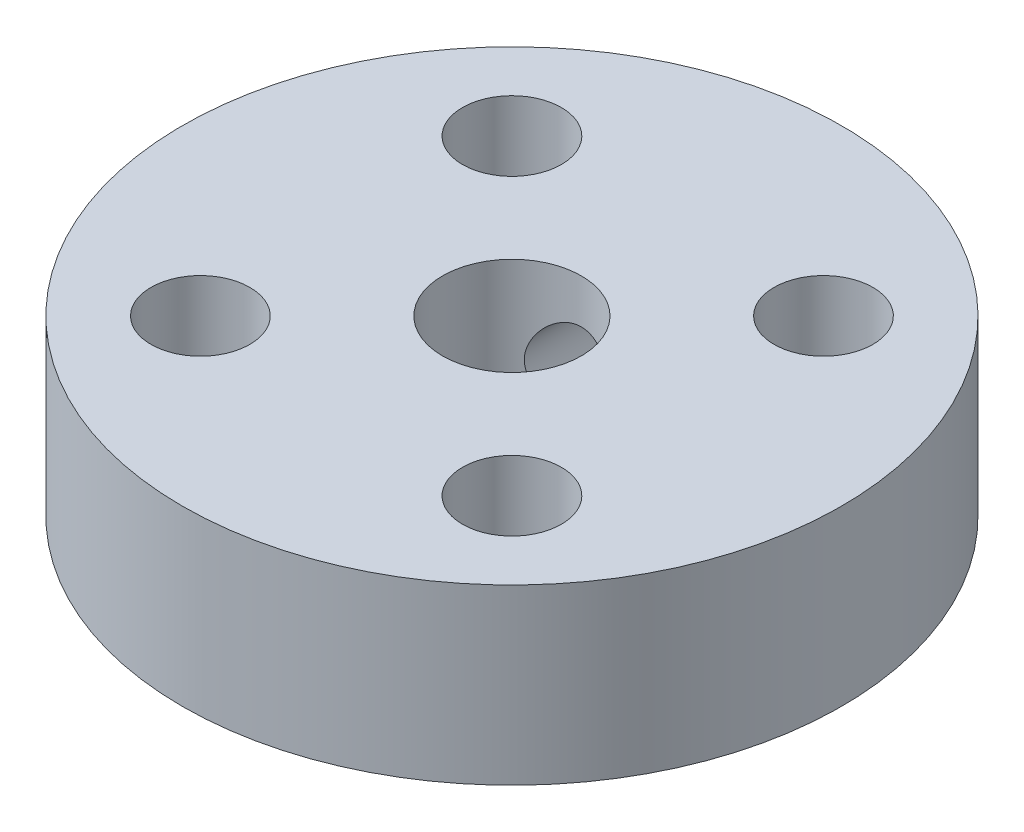
ISO-10303-21;
HEADER;
FILE_DESCRIPTION(('STEP AP214'),'2;1');
FILE_NAME('part.step','',(''),(''),'','','');
FILE_SCHEMA(('AUTOMOTIVE_DESIGN { 1 0 10303 214 1 1 1 1 }'));
ENDSEC;
DATA;
#1=APPLICATION_CONTEXT('core data for automotive mechanical design processes');
#2=APPLICATION_PROTOCOL_DEFINITION('international standard','automotive_design',2000,#1);
#3=PRODUCT_CONTEXT('',#1,'mechanical');
#4=PRODUCT('Part','Part','',(#3));
#5=PRODUCT_RELATED_PRODUCT_CATEGORY('part','',(#4));
#6=PRODUCT_DEFINITION_FORMATION('','',#4);
#7=PRODUCT_DEFINITION_CONTEXT('part definition',#1,'design');
#8=PRODUCT_DEFINITION('design','',#6,#7);
#9=PRODUCT_DEFINITION_SHAPE('','',#8);
#10=(LENGTH_UNIT() NAMED_UNIT(*) SI_UNIT(.MILLI.,.METRE.));
#11=(NAMED_UNIT(*) PLANE_ANGLE_UNIT() SI_UNIT($,.RADIAN.));
#12=(NAMED_UNIT(*) SI_UNIT($,.STERADIAN.) SOLID_ANGLE_UNIT());
#13=UNCERTAINTY_MEASURE_WITH_UNIT(LENGTH_MEASURE(1.E-05),#10,'distance_accuracy_value','');
#14=(GEOMETRIC_REPRESENTATION_CONTEXT(3) GLOBAL_UNCERTAINTY_ASSIGNED_CONTEXT((#13)) GLOBAL_UNIT_ASSIGNED_CONTEXT((#10,
#11,#12)) REPRESENTATION_CONTEXT('',''));
#15=CARTESIAN_POINT('',(0.,0.,0.));
#16=DIRECTION('',(0.,0.,1.));
#17=DIRECTION('',(1.,0.,0.));
#18=AXIS2_PLACEMENT_3D('',#15,#16,#17);
#19=CARTESIAN_POINT('',(0.,5.,0.));
#20=DIRECTION('',(0.,1.,0.));
#21=DIRECTION('',(0.,0.,1.));
#22=AXIS2_PLACEMENT_3D('',#19,#20,#21);
#23=PLANE('',#22);
#24=CARTESIAN_POINT('',(4.4901280605346,5.,4.49012806053455));
#25=DIRECTION('',(0.,1.,0.));
#26=DIRECTION('',(0.,0.,1.));
#27=AXIS2_PLACEMENT_3D('',#24,#25,#26);
#28=CIRCLE('',#27,1.425);
#29=CARTESIAN_POINT('',(4.4901280605346,5.,5.91512806053455));
#30=VERTEX_POINT('',#29);
#31=EDGE_CURVE('E58',#30,#30,#28,.T.);
#32=ORIENTED_EDGE('',*,*,#31,.F.);
#33=EDGE_LOOP('',(#32));
#34=FACE_BOUND('',#33,.T.);
#35=CARTESIAN_POINT('',(-4.4901280605346,5.,-4.49012806053455));
#36=DIRECTION('',(0.,1.,0.));
#37=DIRECTION('',(0.,0.,1.));
#38=AXIS2_PLACEMENT_3D('',#35,#36,#37);
#39=CIRCLE('',#38,1.425);
#40=CARTESIAN_POINT('',(-4.4901280605346,5.,-3.06512806053455));
#41=VERTEX_POINT('',#40);
#42=EDGE_CURVE('E46',#41,#41,#39,.T.);
#43=ORIENTED_EDGE('',*,*,#42,.F.);
#44=EDGE_LOOP('',(#43));
#45=FACE_BOUND('',#44,.T.);
#46=CARTESIAN_POINT('',(0.,5.,0.));
#47=DIRECTION('',(0.,1.,0.));
#48=DIRECTION('',(0.,0.,1.));
#49=AXIS2_PLACEMENT_3D('',#46,#47,#48);
#50=CIRCLE('',#49,9.5);
#51=CARTESIAN_POINT('',(0.,5.,9.5));
#52=VERTEX_POINT('',#51);
#53=EDGE_CURVE('E10',#52,#52,#50,.T.);
#54=ORIENTED_EDGE('',*,*,#53,.T.);
#55=EDGE_LOOP('',(#54));
#56=FACE_BOUND('',#55,.T.);
#57=CARTESIAN_POINT('',(0.,5.,0.));
#58=DIRECTION('',(0.,1.,0.));
#59=DIRECTION('',(0.,0.,1.));
#60=AXIS2_PLACEMENT_3D('',#57,#58,#59);
#61=CIRCLE('',#60,2.);
#62=CARTESIAN_POINT('',(0.,5.,2.));
#63=VERTEX_POINT('',#62);
#64=EDGE_CURVE('E41',#63,#63,#61,.T.);
#65=ORIENTED_EDGE('',*,*,#64,.F.);
#66=EDGE_LOOP('',(#65));
#67=FACE_BOUND('',#66,.T.);
#68=CARTESIAN_POINT('',(4.4901280605346,5.,-4.49012806053455));
#69=DIRECTION('',(0.,1.,0.));
#70=DIRECTION('',(0.,0.,-1.));
#71=AXIS2_PLACEMENT_3D('',#68,#69,#70);
#72=CIRCLE('',#71,1.425);
#73=CARTESIAN_POINT('',(4.4901280605346,5.,-5.91512806053455));
#74=VERTEX_POINT('',#73);
#75=EDGE_CURVE('E52',#74,#74,#72,.T.);
#76=ORIENTED_EDGE('',*,*,#75,.F.);
#77=EDGE_LOOP('',(#76));
#78=FACE_BOUND('',#77,.T.);
#79=CARTESIAN_POINT('',(-4.4901280605346,5.,4.49012806053455));
#80=DIRECTION('',(0.,1.,0.));
#81=DIRECTION('',(0.,0.,-1.));
#82=AXIS2_PLACEMENT_3D('',#79,#80,#81);
#83=CIRCLE('',#82,1.425);
#84=CARTESIAN_POINT('',(-4.4901280605346,5.,3.06512806053455));
#85=VERTEX_POINT('',#84);
#86=EDGE_CURVE('E64',#85,#85,#83,.T.);
#87=ORIENTED_EDGE('',*,*,#86,.F.);
#88=EDGE_LOOP('',(#87));
#89=FACE_BOUND('',#88,.T.);
#90=ADVANCED_FACE('F30',(#34,#45,#56,#67,#78,#89),#23,.T.);
#91=CARTESIAN_POINT('',(0.,0.,0.));
#92=DIRECTION('',(0.,1.,0.));
#93=DIRECTION('',(0.,0.,1.));
#94=AXIS2_PLACEMENT_3D('',#91,#92,#93);
#95=PLANE('',#94);
#96=CARTESIAN_POINT('',(0.,0.,0.));
#97=DIRECTION('',(0.,1.,0.));
#98=DIRECTION('',(0.,0.,1.));
#99=AXIS2_PLACEMENT_3D('',#96,#97,#98);
#100=CIRCLE('',#99,9.5);
#101=CARTESIAN_POINT('',(0.,0.,9.5));
#102=VERTEX_POINT('',#101);
#103=EDGE_CURVE('E34',#102,#102,#100,.T.);
#104=ORIENTED_EDGE('',*,*,#103,.F.);
#105=EDGE_LOOP('',(#104));
#106=FACE_BOUND('',#105,.T.);
#107=CARTESIAN_POINT('',(0.,0.,0.));
#108=DIRECTION('',(0.,1.,0.));
#109=DIRECTION('',(0.,0.,1.));
#110=AXIS2_PLACEMENT_3D('',#107,#108,#109);
#111=CIRCLE('',#110,2.);
#112=CARTESIAN_POINT('',(0.,0.,2.));
#113=VERTEX_POINT('',#112);
#114=EDGE_CURVE('E43',#113,#113,#111,.T.);
#115=ORIENTED_EDGE('',*,*,#114,.T.);
#116=EDGE_LOOP('',(#115));
#117=FACE_BOUND('',#116,.T.);
#118=CARTESIAN_POINT('',(-4.4901280605346,0.,-4.49012806053455));
#119=DIRECTION('',(0.,1.,0.));
#120=DIRECTION('',(0.,0.,1.));
#121=AXIS2_PLACEMENT_3D('',#118,#119,#120);
#122=CIRCLE('',#121,1.425);
#123=CARTESIAN_POINT('',(-4.4901280605346,0.,-3.06512806053455));
#124=VERTEX_POINT('',#123);
#125=EDGE_CURVE('E49',#124,#124,#122,.T.);
#126=ORIENTED_EDGE('',*,*,#125,.T.);
#127=EDGE_LOOP('',(#126));
#128=FACE_BOUND('',#127,.T.);
#129=CARTESIAN_POINT('',(4.4901280605346,0.,-4.49012806053455));
#130=DIRECTION('',(0.,1.,0.));
#131=DIRECTION('',(0.,0.,-1.));
#132=AXIS2_PLACEMENT_3D('',#129,#130,#131);
#133=CIRCLE('',#132,1.425);
#134=CARTESIAN_POINT('',(4.4901280605346,0.,-5.91512806053455));
#135=VERTEX_POINT('',#134);
#136=EDGE_CURVE('E55',#135,#135,#133,.T.);
#137=ORIENTED_EDGE('',*,*,#136,.T.);
#138=EDGE_LOOP('',(#137));
#139=FACE_BOUND('',#138,.T.);
#140=CARTESIAN_POINT('',(4.4901280605346,0.,4.49012806053455));
#141=DIRECTION('',(0.,1.,0.));
#142=DIRECTION('',(0.,0.,1.));
#143=AXIS2_PLACEMENT_3D('',#140,#141,#142);
#144=CIRCLE('',#143,1.425);
#145=CARTESIAN_POINT('',(4.4901280605346,0.,5.91512806053455));
#146=VERTEX_POINT('',#145);
#147=EDGE_CURVE('E61',#146,#146,#144,.T.);
#148=ORIENTED_EDGE('',*,*,#147,.T.);
#149=EDGE_LOOP('',(#148));
#150=FACE_BOUND('',#149,.T.);
#151=CARTESIAN_POINT('',(-4.4901280605346,0.,4.49012806053455));
#152=DIRECTION('',(0.,1.,0.));
#153=DIRECTION('',(0.,0.,-1.));
#154=AXIS2_PLACEMENT_3D('',#151,#152,#153);
#155=CIRCLE('',#154,1.425);
#156=CARTESIAN_POINT('',(-4.4901280605346,0.,3.06512806053455));
#157=VERTEX_POINT('',#156);
#158=EDGE_CURVE('E67',#157,#157,#155,.T.);
#159=ORIENTED_EDGE('',*,*,#158,.T.);
#160=EDGE_LOOP('',(#159));
#161=FACE_BOUND('',#160,.T.);
#162=ADVANCED_FACE('F112',(#106,#117,#128,#139,#150,#161),#95,.F.);
#163=CARTESIAN_POINT('',(0.,5.,0.));
#164=DIRECTION('',(0.,-1.,0.));
#165=DIRECTION('',(0.,0.,-1.));
#166=AXIS2_PLACEMENT_3D('',#163,#164,#165);
#167=CYLINDRICAL_SURFACE('',#166,9.5);
#168=CARTESIAN_POINT('',(-1.225,2.5,-9.42068866909421));
#169=CARTESIAN_POINT('',(-1.22499709865934,2.56850119476712,-9.42068968008304));
#170=CARTESIAN_POINT('',(-1.21923479283014,2.6370447592432,-9.42144388417472));
#171=CARTESIAN_POINT('',(-1.19633965153308,2.77222302420468,-9.42437793764247));
#172=CARTESIAN_POINT('',(-1.1791950498231,2.83885567488312,-9.42655926224454));
#173=CARTESIAN_POINT('',(-1.13405027100076,2.96823545388233,-9.43209647166226));
#174=CARTESIAN_POINT('',(-1.10605760197875,3.03098523483047,-9.43545154395581));
#175=CARTESIAN_POINT('',(-1.04002762035908,3.15088540878797,-9.44295724017658));
#176=CARTESIAN_POINT('',(-1.0019919758161,3.20803672949583,-9.44710773195988));
#177=CARTESIAN_POINT('',(-0.91671354986486,3.31546884468767,-9.45576424826968));
#178=CARTESIAN_POINT('',(-0.869422924253469,3.36571152249943,-9.4602720445942));
#179=CARTESIAN_POINT('',(-0.767079996828368,3.45757073467239,-9.46911934002949));
#180=CARTESIAN_POINT('',(-0.712027303364591,3.49918683350105,-9.47345883063398));
#181=CARTESIAN_POINT('',(-0.595482661690747,3.57274891533215,-9.48149877143937));
#182=CARTESIAN_POINT('',(-0.533968705418879,3.60466030435623,-9.48519691579327));
#183=CARTESIAN_POINT('',(-0.406399064978234,3.65768548186576,-9.49151798583682));
#184=CARTESIAN_POINT('',(-0.340343559854838,3.67879969574093,-9.49414095388573));
#185=CARTESIAN_POINT('',(-0.205956211650491,3.70951701440922,-9.4980036518478));
#186=CARTESIAN_POINT('',(-0.13763909495843,3.71918357285662,-9.49925100404057));
#187=CARTESIAN_POINT('',(-0.000341748230942986,3.72692788963726,-9.50024797059137));
#188=CARTESIAN_POINT('',(0.068638454020692,3.72500613143482,-9.4999976474324));
#189=CARTESIAN_POINT('',(0.204871983670085,3.70967910541163,-9.49803362376351));
#190=CARTESIAN_POINT('',(0.272133132166906,3.69634208362378,-9.4963286202373));
#191=CARTESIAN_POINT('',(0.403454548429558,3.65866986663005,-9.49165656214839));
#192=CARTESIAN_POINT('',(0.467514752040359,3.63433445108667,-9.48868948230183));
#193=CARTESIAN_POINT('',(0.590826431677813,3.57528406300864,-9.48181167065156));
#194=CARTESIAN_POINT('',(0.650063666318719,3.54053967437055,-9.47789827064131));
#195=CARTESIAN_POINT('',(0.761892536540219,3.46167901529738,-9.46956540351521));
#196=CARTESIAN_POINT('',(0.814483847675381,3.41756228759844,-9.46514591171268));
#197=CARTESIAN_POINT('',(0.911929141022382,3.32082732235275,-9.45625727078792));
#198=CARTESIAN_POINT('',(0.956724072172464,3.26814959104126,-9.45178799427617));
#199=CARTESIAN_POINT('',(1.03684578034223,3.15599199010327,-9.44333516613547));
#200=CARTESIAN_POINT('',(1.07217252414367,3.09651209661306,-9.43935161621067));
#201=CARTESIAN_POINT('',(1.13235910536284,2.97238466886437,-9.43232134352188));
#202=CARTESIAN_POINT('',(1.15721401733789,2.90773471983353,-9.42927506178475));
#203=CARTESIAN_POINT('',(1.19569800568057,2.77513057580906,-9.42447270941835));
#204=CARTESIAN_POINT('',(1.20932765905175,2.70717655084254,-9.42271657247324));
#205=CARTESIAN_POINT('',(1.22489562531942,2.57041531713493,-9.42070554215065));
#206=CARTESIAN_POINT('',(1.22691712952424,2.50161772951241,-9.42043996678131));
#207=CARTESIAN_POINT('',(1.21943109855477,2.36466485582994,-9.42141186251064));
#208=CARTESIAN_POINT('',(1.20992382530383,2.29650955521326,-9.42264929946224));
#209=CARTESIAN_POINT('',(1.17972023734672,2.16302646631099,-9.42647803518881));
#210=CARTESIAN_POINT('',(1.15906437506381,2.09768937217438,-9.42906443813355));
#211=CARTESIAN_POINT('',(1.10719165791381,1.97140591034599,-9.43529570470319));
#212=CARTESIAN_POINT('',(1.07597440955179,1.91045970635213,-9.43894060776486));
#213=CARTESIAN_POINT('',(1.00366120554461,1.79431218431,-9.44690371262752));
#214=CARTESIAN_POINT('',(0.962510797466786,1.73914502353837,-9.45122557794094));
#215=CARTESIAN_POINT('',(0.871576170013216,1.63647047895179,-9.46004421015653));
#216=CARTESIAN_POINT('',(0.821791592798144,1.5889634127636,-9.46454098430172));
#217=CARTESIAN_POINT('',(0.714637979391556,1.5026644172879,-9.47323565943418));
#218=CARTESIAN_POINT('',(0.657224677630269,1.46392722209951,-9.4774315774273));
#219=CARTESIAN_POINT('',(0.536658052416349,1.39664668034297,-9.48502195656067));
#220=CARTESIAN_POINT('',(0.473504850999519,1.36810311711194,-9.48841643473478));
#221=CARTESIAN_POINT('',(0.343431378376751,1.32211004489426,-9.4940126841113));
#222=CARTESIAN_POINT('',(0.276522354598678,1.30462915415568,-9.49621782647846));
#223=CARTESIAN_POINT('',(0.140688479557643,1.28115562761889,-9.49920096649316));
#224=CARTESIAN_POINT('',(0.071763725489932,1.2751624388265,-9.49997903283711));
#225=CARTESIAN_POINT('',(-0.0656111858377317,1.2748452363498,-9.50001997731717));
#226=CARTESIAN_POINT('',(-0.134061160436176,1.28043692223984,-9.49929380147855));
#227=CARTESIAN_POINT('',(-0.269039738514282,1.30295188328429,-9.49642965580152));
#228=CARTESIAN_POINT('',(-0.33556834394316,1.31987514694247,-9.49429168739544));
#229=CARTESIAN_POINT('',(-0.46480284180257,1.36454588323132,-9.48884308963059));
#230=CARTESIAN_POINT('',(-0.527510243432013,1.39228905004048,-9.4855329267992));
#231=CARTESIAN_POINT('',(-0.647392805316869,1.457803317978,-9.47810603907808));
#232=CARTESIAN_POINT('',(-0.704567882761629,1.49557456918017,-9.47398930211794));
#233=CARTESIAN_POINT('',(-0.812193090166347,1.58038375295096,-9.46537278747054));
#234=CARTESIAN_POINT('',(-0.862593639257869,1.62748435840921,-9.46087054299941));
#235=CARTESIAN_POINT('',(-0.954808074519508,1.72948459783111,-9.45201001533674));
#236=CARTESIAN_POINT('',(-0.996619927570788,1.78438607322779,-9.44765176643629));
#237=CARTESIAN_POINT('',(-1.07061830989047,1.90068953273254,-9.43955358876871));
#238=CARTESIAN_POINT('',(-1.10276459219988,1.9621172947508,-9.43581627364353));
#239=CARTESIAN_POINT('',(-1.156238941261,2.08951407845013,-9.42941372919864));
#240=CARTESIAN_POINT('',(-1.17757869584358,2.15547810580789,-9.42674734226222));
#241=CARTESIAN_POINT('',(-1.20376377300374,2.26814775002131,-9.42343143541802));
#242=CARTESIAN_POINT('',(-1.21171580127918,2.31414465794692,-9.42240806793997));
#243=CARTESIAN_POINT('',(-1.222334880445,2.40675450221404,-9.42103634345504));
#244=CARTESIAN_POINT('',(-1.22500197510368,2.45336743345059,-9.42068798085798));
#245=CARTESIAN_POINT('',(-1.225,2.5,-9.42068866909421));
#246=B_SPLINE_CURVE_WITH_KNOTS('',3,(#168,#169,#170,#171,#172,#173,#174,#175,#176,#177,#178,
#179,#180,#181,#182,#183,#184,#185,#186,#187,#188,#189,#190,#191,#192,#193,#194,#195,#196,#197,
#198,#199,#200,#201,#202,#203,#204,#205,#206,#207,#208,#209,#210,#211,#212,#213,#214,#215,#216,
#217,#218,#219,#220,#221,#222,#223,#224,#225,#226,#227,#228,#229,#230,#231,#232,#233,#234,#235,
#236,#237,#238,#239,#240,#241,#242,#243,#244,#245),.UNSPECIFIED.,.T.,.F.,(4,2,2,2,2,2,2,2,2,2,2,
2,2,2,2,2,2,2,2,2,2,2,2,2,2,2,2,2,2,2,2,2,2,2,2,2,2,2,4),(0.,0.205333215114874,
0.410879020910187,0.616282819086175,0.821652522836657,1.0281133640807,1.23458462643422,
1.44178348683321,1.64897418333223,1.85501097753251,2.06103917594161,2.26584417243452,
2.4706532720923,2.67604671827297,2.88145018762689,3.08834744940733,3.29524543705798,
3.50224063115709,3.70922518457355,3.91472448691588,4.12021912058811,4.32497308534553,
4.52973467964317,4.7356453165044,4.94156448928137,5.14873542685684,5.35590196080826,
5.56247815461618,5.76904440402421,5.97411279980967,6.17918098754738,6.38416765075679,
6.58915738183673,6.79557399358082,7.00203941216271,7.20935300158032,7.41644188893379,
7.5562247664638,7.6960064863477),.UNSPECIFIED.);
#247=CARTESIAN_POINT('',(-1.225,2.5,-9.42068866909421));
#248=VERTEX_POINT('',#247);
#249=EDGE_CURVE('E79',#248,#248,#246,.T.);
#250=ORIENTED_EDGE('',*,*,#249,.F.);
#251=EDGE_LOOP('',(#250));
#252=FACE_BOUND('',#251,.T.);
#253=ORIENTED_EDGE('',*,*,#53,.F.);
#254=EDGE_LOOP('',(#253));
#255=FACE_BOUND('',#254,.T.);
#256=ORIENTED_EDGE('',*,*,#103,.T.);
#257=EDGE_LOOP('',(#256));
#258=FACE_BOUND('',#257,.T.);
#259=ADVANCED_FACE('F32',(#252,#255,#258),#167,.T.);
#260=CARTESIAN_POINT('',(0.,5.,0.));
#261=DIRECTION('',(0.,-1.,0.));
#262=DIRECTION('',(0.,0.,-1.));
#263=AXIS2_PLACEMENT_3D('',#260,#261,#262);
#264=CYLINDRICAL_SURFACE('',#263,2.);
#265=CARTESIAN_POINT('',(-1.225,2.5,-1.58094117537624));
#266=CARTESIAN_POINT('',(-1.22499122147415,2.56120620332825,-1.5809539788787));
#267=CARTESIAN_POINT('',(-1.2203723876472,2.62249395363184,-1.5845609560338));
#268=CARTESIAN_POINT('',(-1.20220361919125,2.74305443233471,-1.59838193059175));
#269=CARTESIAN_POINT('',(-1.1886273103594,2.80232066500172,-1.60861543735262));
#270=CARTESIAN_POINT('',(-1.15348662694621,2.91670820721222,-1.63399191134482));
#271=CARTESIAN_POINT('',(-1.13198912026802,2.97185969488396,-1.64909365283668));
#272=CARTESIAN_POINT('',(-1.08181120544,3.07770598551229,-1.68243574341253));
#273=CARTESIAN_POINT('',(-1.05313114331982,3.12840100300664,-1.70067594128375));
#274=CARTESIAN_POINT('',(-0.98511491413823,3.23105034980388,-1.741064189181));
#275=CARTESIAN_POINT('',(-0.944883972757908,3.28233284791586,-1.76341343791531));
#276=CARTESIAN_POINT('',(-0.856736512751712,3.37798749191381,-1.80788375439534));
#277=CARTESIAN_POINT('',(-0.808813529713482,3.422353763014,-1.83000461341121));
#278=CARTESIAN_POINT('',(-0.700014852753092,3.50792907961455,-1.87451642871692));
#279=CARTESIAN_POINT('',(-0.638285036903312,3.54819951239879,-1.89664993622898));
#280=CARTESIAN_POINT('',(-0.507312576535772,3.61746577489249,-1.93579134016997));
#281=CARTESIAN_POINT('',(-0.43807720031144,3.64647238976909,-1.95280413617964));
#282=CARTESIAN_POINT('',(-0.30126228630364,3.68932135994803,-1.97828081943678));
#283=CARTESIAN_POINT('',(-0.234191994672972,3.70437644408653,-1.98742197507357));
#284=CARTESIAN_POINT('',(-0.0979215837997548,3.72300910326114,-1.99876675643667));
#285=CARTESIAN_POINT('',(-0.0287236524841506,3.72659809538545,-2.00097728313089));
#286=CARTESIAN_POINT('',(0.100194961644733,3.72237483164824,-1.99839356162764));
#287=CARTESIAN_POINT('',(0.159986220722439,3.71597419490876,-1.99446650184842));
#288=CARTESIAN_POINT('',(0.277455220580947,3.69465746203092,-1.98154217338069));
#289=CARTESIAN_POINT('',(0.335132801363347,3.67974072266307,-1.97254452170611));
#290=CARTESIAN_POINT('',(0.447195549813713,3.64199622308899,-1.95020482645198));
#291=CARTESIAN_POINT('',(0.501565681914992,3.61913510840009,-1.93684448058774));
#292=CARTESIAN_POINT('',(0.605753034571028,3.56635002352211,-1.90683152844591));
#293=CARTESIAN_POINT('',(0.655569142925062,3.53642433435497,-1.89017812104894));
#294=CARTESIAN_POINT('',(0.755753589264726,3.46625334650885,-1.85257563753712));
#295=CARTESIAN_POINT('',(0.805447607065019,3.42519440982087,-1.83135035457286));
#296=CARTESIAN_POINT('',(0.897671002895369,3.33602307160525,-1.78795717916508));
#297=CARTESIAN_POINT('',(0.940190116448492,3.28790074598303,-1.7657879921639));
#298=CARTESIAN_POINT('',(1.02216647440352,3.17897343231021,-1.71978015012407));
#299=CARTESIAN_POINT('',(1.06060111057787,3.1173363511981,-1.69607231164618));
#300=CARTESIAN_POINT('',(1.12638646804965,2.987012058473,-1.65311942761175));
#301=CARTESIAN_POINT('',(1.15375769840297,2.91833819060353,-1.63386615290721));
#302=CARTESIAN_POINT('',(1.19053390778286,2.79381201306798,-1.60717373797391));
#303=CARTESIAN_POINT('',(1.20274243278461,2.73916667198975,-1.5979729601045));
#304=CARTESIAN_POINT('',(1.21957315180789,2.62810329693352,-1.58516812947171));
#305=CARTESIAN_POINT('',(1.22420491990948,2.57168759207479,-1.58155701385547));
#306=CARTESIAN_POINT('',(1.22560791264349,2.45859601983087,-1.58047035593654));
#307=CARTESIAN_POINT('',(1.22236489925028,2.40191986640861,-1.58300592715822));
#308=CARTESIAN_POINT('',(1.2081988053153,2.29008648754689,-1.59384157802492));
#309=CARTESIAN_POINT('',(1.19726948777725,2.23493053345897,-1.6021463389706));
#310=CARTESIAN_POINT('',(1.1684393803391,2.12794961656836,-1.62328722211386));
#311=CARTESIAN_POINT('',(1.1505984988789,2.07610037176594,-1.63608431828205));
#312=CARTESIAN_POINT('',(1.10859533903588,1.97598443919135,-1.66483119213558));
#313=CARTESIAN_POINT('',(1.08443075420732,1.92771906682826,-1.68078211959852));
#314=CARTESIAN_POINT('',(1.02530036073911,1.82663503593026,-1.71760994257343));
#315=CARTESIAN_POINT('',(0.989162164500907,1.77463453463172,-1.7388515832906));
#316=CARTESIAN_POINT('',(0.909439015008524,1.67687795496683,-1.78184629839693));
#317=CARTESIAN_POINT('',(0.865846598978016,1.63112821792858,-1.80359986629392));
#318=CARTESIAN_POINT('',(0.764950400226492,1.54046154679785,-1.84887267283765));
#319=CARTESIAN_POINT('',(0.706575309313424,1.4966232288238,-1.87219186233137));
#320=CARTESIAN_POINT('',(0.581832515257148,1.41950890359171,-1.91462808186235));
#321=CARTESIAN_POINT('',(0.515469451634931,1.38622680558694,-1.93374753310689));
#322=CARTESIAN_POINT('',(0.381085180966447,1.33370407194699,-1.96448449214685));
#323=CARTESIAN_POINT('',(0.313471995061788,1.31367295087942,-1.97651834447809));
#324=CARTESIAN_POINT('',(0.17497973581579,1.28551157388461,-1.99354651128063));
#325=CARTESIAN_POINT('',(0.104104873389868,1.27736639414246,-1.99854965311692));
#326=CARTESIAN_POINT('',(-0.0280642880117464,1.27379412073637,-2.00073945831122));
#327=CARTESIAN_POINT('',(-0.089304860170021,1.27674020931281,-1.99892601283891));
#328=CARTESIAN_POINT('',(-0.210257875910212,1.29164259892076,-1.98984098555084));
#329=CARTESIAN_POINT('',(-0.269970340979631,1.30359877318475,-1.98256948052733));
#330=CARTESIAN_POINT('',(-0.384771442844798,1.3355083394685,-1.96348108234412));
#331=CARTESIAN_POINT('',(-0.439938297166457,1.3552546317581,-1.95178219533932));
#332=CARTESIAN_POINT('',(-0.546157075968082,1.40195337693111,-1.92476471093372));
#333=CARTESIAN_POINT('',(-0.597208211118611,1.42890720784708,-1.90944542140163));
#334=CARTESIAN_POINT('',(-0.699630357754697,1.49245207814085,-1.87449956080282));
#335=CARTESIAN_POINT('',(-0.750455353872598,1.52976414935293,-1.85458791602334));
#336=CARTESIAN_POINT('',(-0.845507756854067,1.61136475197523,-1.81323183989662));
#337=CARTESIAN_POINT('',(-0.889727427740392,1.65566134062885,-1.79178565412615));
#338=CARTESIAN_POINT('',(-0.976511453519425,1.75697438542684,-1.74617849039532));
#339=CARTESIAN_POINT('',(-1.0180334653938,1.81490140101793,-1.72204481735953));
#340=CARTESIAN_POINT('',(-1.09081914521455,1.9380057057893,-1.67688746505844));
#341=CARTESIAN_POINT('',(-1.12209009927782,2.00317780109014,-1.65586158273938));
#342=CARTESIAN_POINT('',(-1.167354027814,2.12435054220383,-1.62415246344603));
#343=CARTESIAN_POINT('',(-1.183643761339,2.17916235887018,-1.61220874933955));
#344=CARTESIAN_POINT('',(-1.20844465733026,2.29129714241417,-1.59370967295701));
#345=CARTESIAN_POINT('',(-1.21698134319469,2.34861121379395,-1.5871366373781));
#346=CARTESIAN_POINT('',(-1.22380579588288,2.43748436140981,-1.58186613312067));
#347=CARTESIAN_POINT('',(-1.22500448469233,2.46873153927509,-1.58093463444097));
#348=CARTESIAN_POINT('',(-1.225,2.5,-1.58094117537624));
#349=B_SPLINE_CURVE_WITH_KNOTS('',3,(#265,#266,#267,#268,#269,#270,#271,#272,#273,#274,#275,
#276,#277,#278,#279,#280,#281,#282,#283,#284,#285,#286,#287,#288,#289,#290,#291,#292,#293,#294,
#295,#296,#297,#298,#299,#300,#301,#302,#303,#304,#305,#306,#307,#308,#309,#310,#311,#312,#313,
#314,#315,#316,#317,#318,#319,#320,#321,#322,#323,#324,#325,#326,#327,#328,#329,#330,#331,#332,
#333,#334,#335,#336,#337,#338,#339,#340,#341,#342,#343,#344,#345,#346,#347,#348),.UNSPECIFIED.,
.T.,.F.,(4,2,2,2,2,2,2,2,2,2,2,2,2,2,2,2,2,2,2,2,2,2,2,2,2,2,2,2,2,2,2,2,2,2,2,2,2,2,2,2,2,4),
(0.,0.183499860269888,0.367542439353278,0.550065718653171,0.732580206329855,0.938494453469703,
1.14458266639952,1.37419760206463,1.60359213484091,1.81037968411444,2.01696126532925,
2.19688233397099,2.37681699402352,2.55751642440815,2.73825986863993,2.9410575837934,
3.1441430075896,3.37224886517659,3.59992990498902,3.76944018279764,3.93873609948115,
4.10833834007184,4.27807836221025,4.44637888406714,4.61474087597189,4.81435882116662,
5.01417779619388,5.24291337994946,5.47151674633794,5.68482489545861,5.89786498683916,
6.08095834841906,6.26404913401232,6.44256911164552,6.62112324552369,6.81871110721249,
7.01652859401732,7.24123961477272,7.46579057021953,7.64034441120873,7.81432150753662,
7.9080662239521),.UNSPECIFIED.);
#350=CARTESIAN_POINT('',(-1.225,2.5,-1.58094117537624));
#351=VERTEX_POINT('',#350);
#352=EDGE_CURVE('E70',#351,#351,#349,.T.);
#353=ORIENTED_EDGE('',*,*,#352,.T.);
#354=EDGE_LOOP('',(#353));
#355=FACE_BOUND('',#354,.T.);
#356=ORIENTED_EDGE('',*,*,#64,.T.);
#357=EDGE_LOOP('',(#356));
#358=FACE_BOUND('',#357,.T.);
#359=ORIENTED_EDGE('',*,*,#114,.F.);
#360=EDGE_LOOP('',(#359));
#361=FACE_BOUND('',#360,.T.);
#362=ADVANCED_FACE('F106',(#355,#358,#361),#264,.F.);
#363=CARTESIAN_POINT('',(-4.4901280605346,5.,-4.49012806053455));
#364=DIRECTION('',(0.,-1.,0.));
#365=DIRECTION('',(0.,0.,-1.));
#366=AXIS2_PLACEMENT_3D('',#363,#364,#365);
#367=CYLINDRICAL_SURFACE('',#366,1.425);
#368=ORIENTED_EDGE('',*,*,#42,.T.);
#369=EDGE_LOOP('',(#368));
#370=FACE_BOUND('',#369,.T.);
#371=ORIENTED_EDGE('',*,*,#125,.F.);
#372=EDGE_LOOP('',(#371));
#373=FACE_BOUND('',#372,.T.);
#374=ADVANCED_FACE('F102',(#370,#373),#367,.F.);
#375=CARTESIAN_POINT('',(4.4901280605346,5.,-4.49012806053455));
#376=DIRECTION('',(0.,-1.,0.));
#377=DIRECTION('',(0.,0.,-1.));
#378=AXIS2_PLACEMENT_3D('',#375,#376,#377);
#379=CYLINDRICAL_SURFACE('',#378,1.425);
#380=ORIENTED_EDGE('',*,*,#75,.T.);
#381=EDGE_LOOP('',(#380));
#382=FACE_BOUND('',#381,.T.);
#383=ORIENTED_EDGE('',*,*,#136,.F.);
#384=EDGE_LOOP('',(#383));
#385=FACE_BOUND('',#384,.T.);
#386=ADVANCED_FACE('F98',(#382,#385),#379,.F.);
#387=CARTESIAN_POINT('',(4.4901280605346,5.,4.49012806053455));
#388=DIRECTION('',(0.,-1.,0.));
#389=DIRECTION('',(0.,0.,-1.));
#390=AXIS2_PLACEMENT_3D('',#387,#388,#389);
#391=CYLINDRICAL_SURFACE('',#390,1.425);
#392=ORIENTED_EDGE('',*,*,#31,.T.);
#393=EDGE_LOOP('',(#392));
#394=FACE_BOUND('',#393,.T.);
#395=ORIENTED_EDGE('',*,*,#147,.F.);
#396=EDGE_LOOP('',(#395));
#397=FACE_BOUND('',#396,.T.);
#398=ADVANCED_FACE('F94',(#394,#397),#391,.F.);
#399=CARTESIAN_POINT('',(-4.4901280605346,5.,4.49012806053455));
#400=DIRECTION('',(0.,-1.,0.));
#401=DIRECTION('',(0.,0.,-1.));
#402=AXIS2_PLACEMENT_3D('',#399,#400,#401);
#403=CYLINDRICAL_SURFACE('',#402,1.425);
#404=ORIENTED_EDGE('',*,*,#86,.T.);
#405=EDGE_LOOP('',(#404));
#406=FACE_BOUND('',#405,.T.);
#407=ORIENTED_EDGE('',*,*,#158,.F.);
#408=EDGE_LOOP('',(#407));
#409=FACE_BOUND('',#408,.T.);
#410=ADVANCED_FACE('F89',(#406,#409),#403,.F.);
#411=CARTESIAN_POINT('',(0.,2.5,9.501));
#412=DIRECTION('',(0.,0.,-1.));
#413=DIRECTION('',(-1.,0.,0.));
#414=AXIS2_PLACEMENT_3D('',#411,#412,#413);
#415=CYLINDRICAL_SURFACE('',#414,1.225);
#416=ORIENTED_EDGE('',*,*,#352,.F.);
#417=EDGE_LOOP('',(#416));
#418=FACE_BOUND('',#417,.T.);
#419=ORIENTED_EDGE('',*,*,#249,.T.);
#420=EDGE_LOOP('',(#419));
#421=FACE_BOUND('',#420,.T.);
#422=ADVANCED_FACE('F83',(#418,#421),#415,.F.);
#423=CLOSED_SHELL('',(#90,#162,#259,#362,#374,#386,#398,#410,#422));
#424=MANIFOLD_SOLID_BREP('B2',#423);
#425=ADVANCED_BREP_SHAPE_REPRESENTATION('',(#18,#424),#14);
#426=SHAPE_DEFINITION_REPRESENTATION(#9,#425);
ENDSEC;
END-ISO-10303-21;
